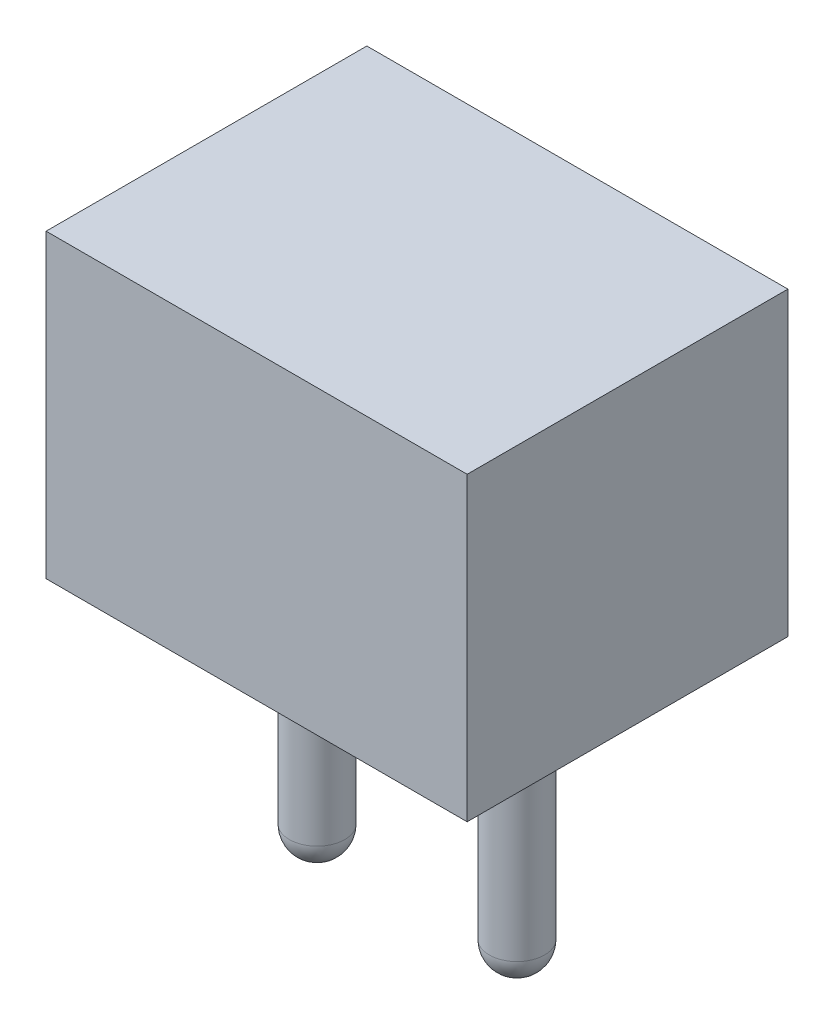
ISO-10303-21;
HEADER;
FILE_DESCRIPTION(('STEP AP214'),'2;1');
FILE_NAME('part.step','',(''),(''),'','','');
FILE_SCHEMA(('AUTOMOTIVE_DESIGN { 1 0 10303 214 1 1 1 1 }'));
ENDSEC;
DATA;
#1=APPLICATION_CONTEXT('core data for automotive mechanical design processes');
#2=APPLICATION_PROTOCOL_DEFINITION('international standard','automotive_design',2000,#1);
#3=PRODUCT_CONTEXT('',#1,'mechanical');
#4=PRODUCT('Part','Part','',(#3));
#5=PRODUCT_RELATED_PRODUCT_CATEGORY('part','',(#4));
#6=PRODUCT_DEFINITION_FORMATION('','',#4);
#7=PRODUCT_DEFINITION_CONTEXT('part definition',#1,'design');
#8=PRODUCT_DEFINITION('design','',#6,#7);
#9=PRODUCT_DEFINITION_SHAPE('','',#8);
#10=(LENGTH_UNIT() NAMED_UNIT(*) SI_UNIT(.MILLI.,.METRE.));
#11=(NAMED_UNIT(*) PLANE_ANGLE_UNIT() SI_UNIT($,.RADIAN.));
#12=(NAMED_UNIT(*) SI_UNIT($,.STERADIAN.) SOLID_ANGLE_UNIT());
#13=UNCERTAINTY_MEASURE_WITH_UNIT(LENGTH_MEASURE(1.E-05),#10,'distance_accuracy_value','');
#14=(GEOMETRIC_REPRESENTATION_CONTEXT(3) GLOBAL_UNCERTAINTY_ASSIGNED_CONTEXT((#13)) GLOBAL_UNIT_ASSIGNED_CONTEXT((#10,
#11,#12)) REPRESENTATION_CONTEXT('',''));
#15=CARTESIAN_POINT('',(0.,0.,0.));
#16=DIRECTION('',(0.,0.,1.));
#17=DIRECTION('',(1.,0.,0.));
#18=AXIS2_PLACEMENT_3D('',#15,#16,#17);
#19=CARTESIAN_POINT('',(-3.93,0.,-2.03));
#20=DIRECTION('',(0.,1.,0.));
#21=DIRECTION('',(0.,0.,1.));
#22=AXIS2_PLACEMENT_3D('',#19,#20,#21);
#23=PLANE('',#22);
#24=CARTESIAN_POINT('',(0.,0.,0.));
#25=DIRECTION('',(0.,1.,0.));
#26=DIRECTION('',(0.,0.,1.));
#27=AXIS2_PLACEMENT_3D('',#24,#25,#26);
#28=CIRCLE('',#27,0.35);
#29=CARTESIAN_POINT('',(0.,0.,0.35));
#30=VERTEX_POINT('',#29);
#31=EDGE_CURVE('E41',#30,#30,#28,.F.);
#32=ORIENTED_EDGE('',*,*,#31,.F.);
#33=EDGE_LOOP('',(#32));
#34=FACE_BOUND('',#33,.T.);
#35=DIRECTION('',(0.,0.,1.));
#36=VECTOR('',#35,1.);
#37=CARTESIAN_POINT('',(-3.93,0.,-2.03));
#38=LINE('',#37,#36);
#39=CARTESIAN_POINT('',(-3.93,0.,-2.03));
#40=VERTEX_POINT('',#39);
#41=CARTESIAN_POINT('',(-3.93,0.,2.03));
#42=VERTEX_POINT('',#41);
#43=EDGE_CURVE('E101',#40,#42,#38,.T.);
#44=ORIENTED_EDGE('',*,*,#43,.F.);
#45=DIRECTION('',(-1.,0.,0.));
#46=VECTOR('',#45,1.);
#47=CARTESIAN_POINT('',(-3.93,0.,-2.03));
#48=LINE('',#47,#46);
#49=CARTESIAN_POINT('',(1.4,0.,-2.03));
#50=VERTEX_POINT('',#49);
#51=EDGE_CURVE('E73',#50,#40,#48,.T.);
#52=ORIENTED_EDGE('',*,*,#51,.F.);
#53=DIRECTION('',(0.,0.,-1.));
#54=VECTOR('',#53,1.);
#55=CARTESIAN_POINT('',(1.4,0.,-2.03));
#56=LINE('',#55,#54);
#57=CARTESIAN_POINT('',(1.4,0.,2.03));
#58=VERTEX_POINT('',#57);
#59=EDGE_CURVE('E67',#58,#50,#56,.T.);
#60=ORIENTED_EDGE('',*,*,#59,.F.);
#61=DIRECTION('',(1.,0.,0.));
#62=VECTOR('',#61,1.);
#63=CARTESIAN_POINT('',(-3.93,0.,2.03));
#64=LINE('',#63,#62);
#65=EDGE_CURVE('E91',#42,#58,#64,.T.);
#66=ORIENTED_EDGE('',*,*,#65,.F.);
#67=EDGE_LOOP('',(#44,#52,#60,#66));
#68=FACE_BOUND('',#67,.T.);
#69=CARTESIAN_POINT('',(-2.53,0.,0.));
#70=DIRECTION('',(0.,1.,0.));
#71=DIRECTION('',(0.,0.,1.));
#72=AXIS2_PLACEMENT_3D('',#69,#70,#71);
#73=CIRCLE('',#72,0.35);
#74=CARTESIAN_POINT('',(-2.53,0.,0.350000000000001));
#75=VERTEX_POINT('',#74);
#76=EDGE_CURVE('E11',#75,#75,#73,.F.);
#77=ORIENTED_EDGE('',*,*,#76,.F.);
#78=EDGE_LOOP('',(#77));
#79=FACE_BOUND('',#78,.T.);
#80=ADVANCED_FACE('F31',(#34,#68,#79),#23,.F.);
#81=CARTESIAN_POINT('',(-3.93,3.81,-2.03));
#82=DIRECTION('',(1.,0.,0.));
#83=DIRECTION('',(0.,0.,-1.));
#84=AXIS2_PLACEMENT_3D('',#81,#82,#83);
#85=PLANE('',#84);
#86=ORIENTED_EDGE('',*,*,#43,.T.);
#87=DIRECTION('',(0.,-1.,0.));
#88=VECTOR('',#87,1.);
#89=CARTESIAN_POINT('',(-3.93,3.81,2.03));
#90=LINE('',#89,#88);
#91=CARTESIAN_POINT('',(-3.93,3.81,2.03));
#92=VERTEX_POINT('',#91);
#93=EDGE_CURVE('E92',#92,#42,#90,.T.);
#94=ORIENTED_EDGE('',*,*,#93,.F.);
#95=DIRECTION('',(0.,0.,1.));
#96=VECTOR('',#95,1.);
#97=CARTESIAN_POINT('',(-3.93,3.81,-2.03));
#98=LINE('',#97,#96);
#99=CARTESIAN_POINT('',(-3.93,3.81,-2.03));
#100=VERTEX_POINT('',#99);
#101=EDGE_CURVE('E86',#100,#92,#98,.T.);
#102=ORIENTED_EDGE('',*,*,#101,.F.);
#103=DIRECTION('',(0.,-1.,0.));
#104=VECTOR('',#103,1.);
#105=CARTESIAN_POINT('',(-3.93,3.81,-2.03));
#106=LINE('',#105,#104);
#107=EDGE_CURVE('E97',#100,#40,#106,.T.);
#108=ORIENTED_EDGE('',*,*,#107,.T.);
#109=EDGE_LOOP('',(#86,#94,#102,#108));
#110=FACE_BOUND('',#109,.T.);
#111=ADVANCED_FACE('F127',(#110),#85,.F.);
#112=CARTESIAN_POINT('',(-3.93,3.81,2.03));
#113=DIRECTION('',(0.,0.,-1.));
#114=DIRECTION('',(-1.,0.,0.));
#115=AXIS2_PLACEMENT_3D('',#112,#113,#114);
#116=PLANE('',#115);
#117=ORIENTED_EDGE('',*,*,#65,.T.);
#118=DIRECTION('',(0.,-1.,0.));
#119=VECTOR('',#118,1.);
#120=CARTESIAN_POINT('',(1.4,3.81,2.03));
#121=LINE('',#120,#119);
#122=CARTESIAN_POINT('',(1.4,3.81,2.03));
#123=VERTEX_POINT('',#122);
#124=EDGE_CURVE('E89',#123,#58,#121,.T.);
#125=ORIENTED_EDGE('',*,*,#124,.F.);
#126=DIRECTION('',(1.,0.,0.));
#127=VECTOR('',#126,1.);
#128=CARTESIAN_POINT('',(-3.93,3.81,2.03));
#129=LINE('',#128,#127);
#130=EDGE_CURVE('E81',#92,#123,#129,.T.);
#131=ORIENTED_EDGE('',*,*,#130,.F.);
#132=ORIENTED_EDGE('',*,*,#93,.T.);
#133=EDGE_LOOP('',(#117,#125,#131,#132));
#134=FACE_BOUND('',#133,.T.);
#135=ADVANCED_FACE('F90',(#134),#116,.F.);
#136=CARTESIAN_POINT('',(1.4,3.81,-2.03));
#137=DIRECTION('',(-1.,0.,0.));
#138=DIRECTION('',(0.,0.,1.));
#139=AXIS2_PLACEMENT_3D('',#136,#137,#138);
#140=PLANE('',#139);
#141=ORIENTED_EDGE('',*,*,#59,.T.);
#142=DIRECTION('',(0.,-1.,0.));
#143=VECTOR('',#142,1.);
#144=CARTESIAN_POINT('',(1.4,3.81,-2.03));
#145=LINE('',#144,#143);
#146=CARTESIAN_POINT('',(1.4,3.81,-2.03));
#147=VERTEX_POINT('',#146);
#148=EDGE_CURVE('E93',#147,#50,#145,.T.);
#149=ORIENTED_EDGE('',*,*,#148,.F.);
#150=DIRECTION('',(0.,0.,-1.));
#151=VECTOR('',#150,1.);
#152=CARTESIAN_POINT('',(1.4,3.81,-2.03));
#153=LINE('',#152,#151);
#154=EDGE_CURVE('E84',#123,#147,#153,.T.);
#155=ORIENTED_EDGE('',*,*,#154,.F.);
#156=ORIENTED_EDGE('',*,*,#124,.T.);
#157=EDGE_LOOP('',(#141,#149,#155,#156));
#158=FACE_BOUND('',#157,.T.);
#159=ADVANCED_FACE('F95',(#158),#140,.F.);
#160=CARTESIAN_POINT('',(-3.93,3.81,-2.03));
#161=DIRECTION('',(0.,0.,1.));
#162=DIRECTION('',(1.,0.,0.));
#163=AXIS2_PLACEMENT_3D('',#160,#161,#162);
#164=PLANE('',#163);
#165=ORIENTED_EDGE('',*,*,#51,.T.);
#166=ORIENTED_EDGE('',*,*,#107,.F.);
#167=DIRECTION('',(-1.,0.,0.));
#168=VECTOR('',#167,1.);
#169=CARTESIAN_POINT('',(-3.93,3.81,-2.03));
#170=LINE('',#169,#168);
#171=EDGE_CURVE('E50',#147,#100,#170,.T.);
#172=ORIENTED_EDGE('',*,*,#171,.F.);
#173=ORIENTED_EDGE('',*,*,#148,.T.);
#174=EDGE_LOOP('',(#165,#166,#172,#173));
#175=FACE_BOUND('',#174,.T.);
#176=ADVANCED_FACE('F140',(#175),#164,.F.);
#177=CARTESIAN_POINT('',(-3.93,3.81,-2.03));
#178=DIRECTION('',(0.,1.,0.));
#179=DIRECTION('',(0.,0.,1.));
#180=AXIS2_PLACEMENT_3D('',#177,#178,#179);
#181=PLANE('',#180);
#182=ORIENTED_EDGE('',*,*,#101,.T.);
#183=ORIENTED_EDGE('',*,*,#130,.T.);
#184=ORIENTED_EDGE('',*,*,#154,.T.);
#185=ORIENTED_EDGE('',*,*,#171,.T.);
#186=EDGE_LOOP('',(#182,#183,#184,#185));
#187=FACE_BOUND('',#186,.T.);
#188=ADVANCED_FACE('F82',(#187),#181,.T.);
#189=CARTESIAN_POINT('',(0.,-3.,0.));
#190=DIRECTION('',(0.,1.,0.));
#191=DIRECTION('',(0.,0.,1.));
#192=AXIS2_PLACEMENT_3D('',#189,#190,#191);
#193=CYLINDRICAL_SURFACE('',#192,0.35);
#194=CARTESIAN_POINT('',(0.,-3.,0.));
#195=DIRECTION('',(0.,-1.,0.));
#196=DIRECTION('',(0.,0.,-1.));
#197=AXIS2_PLACEMENT_3D('',#194,#195,#196);
#198=CIRCLE('',#197,0.35);
#199=CARTESIAN_POINT('',(0.,-3.,-0.35));
#200=VERTEX_POINT('',#199);
#201=EDGE_CURVE('E104',#200,#200,#198,.T.);
#202=ORIENTED_EDGE('',*,*,#201,.F.);
#203=EDGE_LOOP('',(#202));
#204=FACE_BOUND('',#203,.T.);
#205=ORIENTED_EDGE('',*,*,#31,.T.);
#206=EDGE_LOOP('',(#205));
#207=FACE_BOUND('',#206,.T.);
#208=ADVANCED_FACE('F147',(#204,#207),#193,.T.);
#209=CARTESIAN_POINT('',(0.,-3.,0.));
#210=DIRECTION('',(0.,0.,1.));
#211=DIRECTION('',(1.,0.,0.));
#212=AXIS2_PLACEMENT_3D('',#209,#210,#211);
#213=SPHERICAL_SURFACE('',#212,0.35);
#214=CARTESIAN_POINT('',(0.,-3.,0.));
#215=DIRECTION('',(0.,-1.,0.));
#216=DIRECTION('',(0.,0.,-1.));
#217=AXIS2_PLACEMENT_3D('',#214,#215,#216);
#218=SPHERICAL_SURFACE('',#217,0.35);
#219=ORIENTED_EDGE('',*,*,#201,.T.);
#220=EDGE_LOOP('',(#219));
#221=FACE_BOUND('',#220,.T.);
#222=ADVANCED_FACE('F122',(#221),#218,.T.);
#223=CARTESIAN_POINT('',(-2.53,-3.,0.));
#224=DIRECTION('',(0.,1.,0.));
#225=DIRECTION('',(0.,0.,1.));
#226=AXIS2_PLACEMENT_3D('',#223,#224,#225);
#227=CYLINDRICAL_SURFACE('',#226,0.35);
#228=CARTESIAN_POINT('',(-2.53,-3.,0.));
#229=DIRECTION('',(0.,-1.,0.));
#230=DIRECTION('',(0.,0.,1.));
#231=AXIS2_PLACEMENT_3D('',#228,#229,#230);
#232=CIRCLE('',#231,0.35);
#233=CARTESIAN_POINT('',(-2.53,-3.,0.350000000000001));
#234=VERTEX_POINT('',#233);
#235=EDGE_CURVE('E35',#234,#234,#232,.T.);
#236=ORIENTED_EDGE('',*,*,#235,.F.);
#237=EDGE_LOOP('',(#236));
#238=FACE_BOUND('',#237,.T.);
#239=ORIENTED_EDGE('',*,*,#76,.T.);
#240=EDGE_LOOP('',(#239));
#241=FACE_BOUND('',#240,.T.);
#242=ADVANCED_FACE('F119',(#238,#241),#227,.T.);
#243=CARTESIAN_POINT('',(-2.53,-3.,0.));
#244=DIRECTION('',(0.,0.,1.));
#245=DIRECTION('',(1.,0.,0.));
#246=AXIS2_PLACEMENT_3D('',#243,#244,#245);
#247=SPHERICAL_SURFACE('',#246,0.35);
#248=CARTESIAN_POINT('',(-2.53,-3.,0.));
#249=DIRECTION('',(0.,-1.,0.));
#250=DIRECTION('',(0.,0.,1.));
#251=AXIS2_PLACEMENT_3D('',#248,#249,#250);
#252=SPHERICAL_SURFACE('',#251,0.35);
#253=ORIENTED_EDGE('',*,*,#235,.T.);
#254=EDGE_LOOP('',(#253));
#255=FACE_BOUND('',#254,.T.);
#256=ADVANCED_FACE('F33',(#255),#252,.T.);
#257=CLOSED_SHELL('',(#80,#111,#135,#159,#176,#188,#208,#222,#242,#256));
#258=MANIFOLD_SOLID_BREP('B2',#257);
#259=ADVANCED_BREP_SHAPE_REPRESENTATION('',(#18,#258),#14);
#260=SHAPE_DEFINITION_REPRESENTATION(#9,#259);
ENDSEC;
END-ISO-10303-21;
